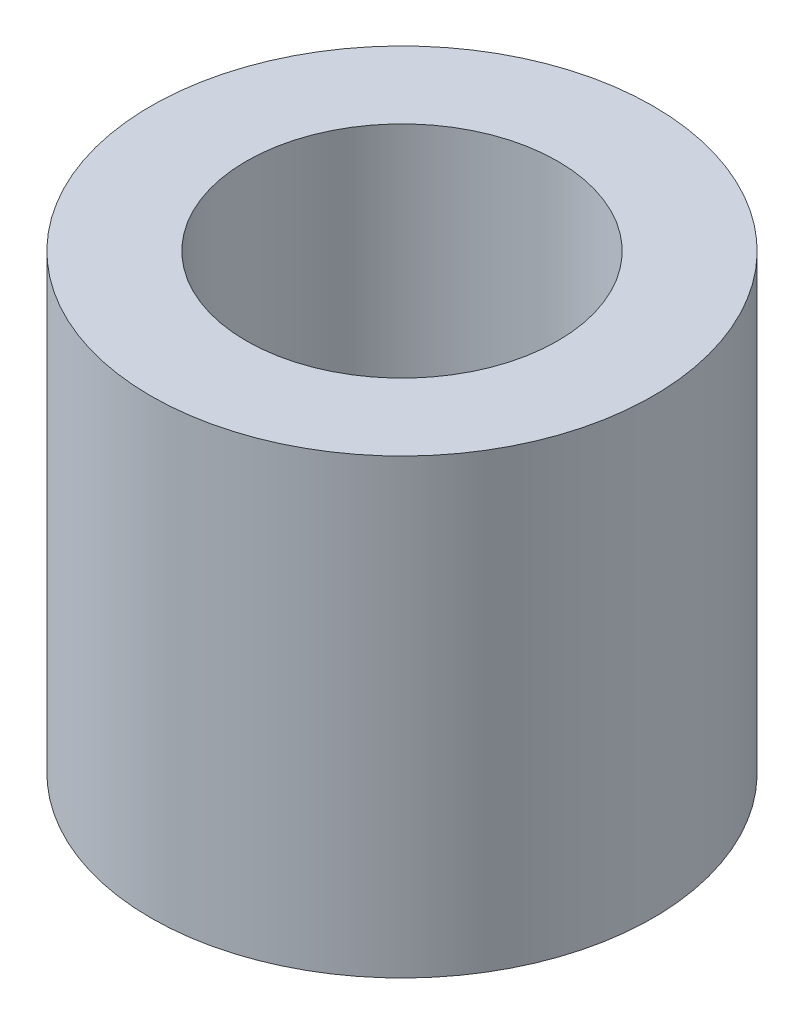
ISO-10303-21;
HEADER;
FILE_DESCRIPTION(('STEP AP214'),'2;1');
FILE_NAME('part.step','',(''),(''),'','','');
FILE_SCHEMA(('AUTOMOTIVE_DESIGN { 1 0 10303 214 1 1 1 1 }'));
ENDSEC;
DATA;
#1=APPLICATION_CONTEXT('core data for automotive mechanical design processes');
#2=APPLICATION_PROTOCOL_DEFINITION('international standard','automotive_design',2000,#1);
#3=PRODUCT_CONTEXT('',#1,'mechanical');
#4=PRODUCT('Part','Part','',(#3));
#5=PRODUCT_RELATED_PRODUCT_CATEGORY('part','',(#4));
#6=PRODUCT_DEFINITION_FORMATION('','',#4);
#7=PRODUCT_DEFINITION_CONTEXT('part definition',#1,'design');
#8=PRODUCT_DEFINITION('design','',#6,#7);
#9=PRODUCT_DEFINITION_SHAPE('','',#8);
#10=(LENGTH_UNIT() NAMED_UNIT(*) SI_UNIT(.MILLI.,.METRE.));
#11=(NAMED_UNIT(*) PLANE_ANGLE_UNIT() SI_UNIT($,.RADIAN.));
#12=(NAMED_UNIT(*) SI_UNIT($,.STERADIAN.) SOLID_ANGLE_UNIT());
#13=UNCERTAINTY_MEASURE_WITH_UNIT(LENGTH_MEASURE(1.E-05),#10,'distance_accuracy_value','');
#14=(GEOMETRIC_REPRESENTATION_CONTEXT(3) GLOBAL_UNCERTAINTY_ASSIGNED_CONTEXT((#13)) GLOBAL_UNIT_ASSIGNED_CONTEXT((#10,
#11,#12)) REPRESENTATION_CONTEXT('',''));
#15=CARTESIAN_POINT('',(0.,0.,0.));
#16=DIRECTION('',(0.,0.,1.));
#17=DIRECTION('',(1.,0.,0.));
#18=AXIS2_PLACEMENT_3D('',#15,#16,#17);
#19=CARTESIAN_POINT('',(0.,4.5,0.));
#20=DIRECTION('',(0.,1.,0.));
#21=DIRECTION('',(0.,0.,1.));
#22=AXIS2_PLACEMENT_3D('',#19,#20,#21);
#23=PLANE('',#22);
#24=CARTESIAN_POINT('',(0.,4.5,0.));
#25=DIRECTION('',(0.,1.,0.));
#26=DIRECTION('',(0.,0.,1.));
#27=AXIS2_PLACEMENT_3D('',#24,#25,#26);
#28=CIRCLE('',#27,2.5);
#29=CARTESIAN_POINT('',(0.,4.5,2.5));
#30=VERTEX_POINT('',#29);
#31=EDGE_CURVE('E10',#30,#30,#28,.T.);
#32=ORIENTED_EDGE('',*,*,#31,.T.);
#33=EDGE_LOOP('',(#32));
#34=FACE_BOUND('',#33,.T.);
#35=CARTESIAN_POINT('',(0.,4.5,0.));
#36=DIRECTION('',(0.,1.,0.));
#37=DIRECTION('',(0.,0.,1.));
#38=AXIS2_PLACEMENT_3D('',#35,#36,#37);
#39=CIRCLE('',#38,1.55);
#40=CARTESIAN_POINT('',(0.,4.5,1.55));
#41=VERTEX_POINT('',#40);
#42=EDGE_CURVE('E43',#41,#41,#39,.T.);
#43=ORIENTED_EDGE('',*,*,#42,.F.);
#44=EDGE_LOOP('',(#43));
#45=FACE_BOUND('',#44,.T.);
#46=ADVANCED_FACE('F32',(#34,#45),#23,.T.);
#47=CARTESIAN_POINT('',(0.,0.,0.));
#48=DIRECTION('',(0.,1.,0.));
#49=DIRECTION('',(0.,0.,1.));
#50=AXIS2_PLACEMENT_3D('',#47,#48,#49);
#51=PLANE('',#50);
#52=CARTESIAN_POINT('',(0.,0.,0.));
#53=DIRECTION('',(0.,1.,0.));
#54=DIRECTION('',(0.,0.,1.));
#55=AXIS2_PLACEMENT_3D('',#52,#53,#54);
#56=CIRCLE('',#55,2.5);
#57=CARTESIAN_POINT('',(0.,0.,2.5));
#58=VERTEX_POINT('',#57);
#59=EDGE_CURVE('E36',#58,#58,#56,.T.);
#60=ORIENTED_EDGE('',*,*,#59,.F.);
#61=EDGE_LOOP('',(#60));
#62=FACE_BOUND('',#61,.T.);
#63=CARTESIAN_POINT('',(0.,0.,0.));
#64=DIRECTION('',(0.,1.,0.));
#65=DIRECTION('',(0.,0.,1.));
#66=AXIS2_PLACEMENT_3D('',#63,#64,#65);
#67=CIRCLE('',#66,1.55);
#68=CARTESIAN_POINT('',(0.,0.,1.55));
#69=VERTEX_POINT('',#68);
#70=EDGE_CURVE('E45',#69,#69,#67,.T.);
#71=ORIENTED_EDGE('',*,*,#70,.T.);
#72=EDGE_LOOP('',(#71));
#73=FACE_BOUND('',#72,.T.);
#74=ADVANCED_FACE('F55',(#62,#73),#51,.F.);
#75=CARTESIAN_POINT('',(0.,4.5,0.));
#76=DIRECTION('',(0.,-1.,0.));
#77=DIRECTION('',(0.,0.,-1.));
#78=AXIS2_PLACEMENT_3D('',#75,#76,#77);
#79=CYLINDRICAL_SURFACE('',#78,2.5);
#80=ORIENTED_EDGE('',*,*,#31,.F.);
#81=EDGE_LOOP('',(#80));
#82=FACE_BOUND('',#81,.T.);
#83=ORIENTED_EDGE('',*,*,#59,.T.);
#84=EDGE_LOOP('',(#83));
#85=FACE_BOUND('',#84,.T.);
#86=ADVANCED_FACE('F34',(#82,#85),#79,.T.);
#87=CARTESIAN_POINT('',(0.,4.5,0.));
#88=DIRECTION('',(0.,-1.,0.));
#89=DIRECTION('',(0.,0.,-1.));
#90=AXIS2_PLACEMENT_3D('',#87,#88,#89);
#91=CYLINDRICAL_SURFACE('',#90,1.55);
#92=ORIENTED_EDGE('',*,*,#42,.T.);
#93=EDGE_LOOP('',(#92));
#94=FACE_BOUND('',#93,.T.);
#95=ORIENTED_EDGE('',*,*,#70,.F.);
#96=EDGE_LOOP('',(#95));
#97=FACE_BOUND('',#96,.T.);
#98=ADVANCED_FACE('F51',(#94,#97),#91,.F.);
#99=CLOSED_SHELL('',(#46,#74,#86,#98));
#100=MANIFOLD_SOLID_BREP('B2',#99);
#101=ADVANCED_BREP_SHAPE_REPRESENTATION('',(#18,#100),#14);
#102=SHAPE_DEFINITION_REPRESENTATION(#9,#101);
ENDSEC;
END-ISO-10303-21;
